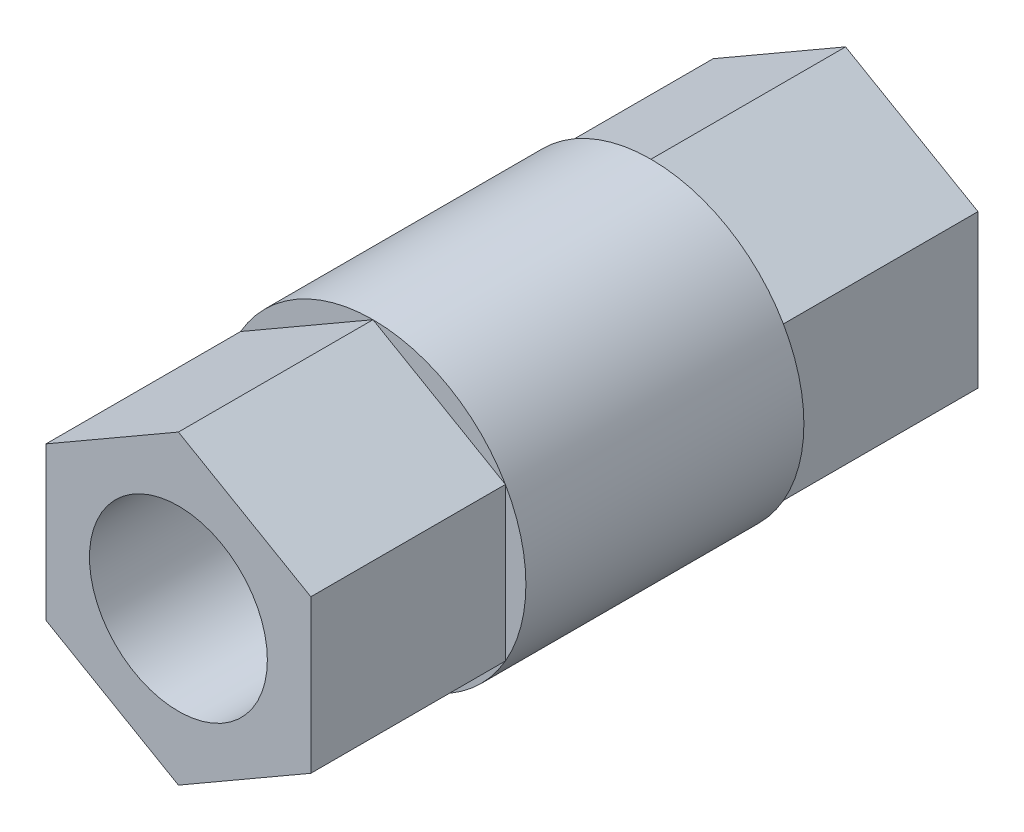
ISO-10303-21;
HEADER;
FILE_DESCRIPTION(('STEP AP214'),'2;1');
FILE_NAME('part.step','',(''),(''),'','','');
FILE_SCHEMA(('AUTOMOTIVE_DESIGN { 1 0 10303 214 1 1 1 1 }'));
ENDSEC;
DATA;
#1=APPLICATION_CONTEXT('core data for automotive mechanical design processes');
#2=APPLICATION_PROTOCOL_DEFINITION('international standard','automotive_design',2000,#1);
#3=PRODUCT_CONTEXT('',#1,'mechanical');
#4=PRODUCT('Part','Part','',(#3));
#5=PRODUCT_RELATED_PRODUCT_CATEGORY('part','',(#4));
#6=PRODUCT_DEFINITION_FORMATION('','',#4);
#7=PRODUCT_DEFINITION_CONTEXT('part definition',#1,'design');
#8=PRODUCT_DEFINITION('design','',#6,#7);
#9=PRODUCT_DEFINITION_SHAPE('','',#8);
#10=(LENGTH_UNIT() NAMED_UNIT(*) SI_UNIT(.MILLI.,.METRE.));
#11=(NAMED_UNIT(*) PLANE_ANGLE_UNIT() SI_UNIT($,.RADIAN.));
#12=(NAMED_UNIT(*) SI_UNIT($,.STERADIAN.) SOLID_ANGLE_UNIT());
#13=UNCERTAINTY_MEASURE_WITH_UNIT(LENGTH_MEASURE(1.E-05),#10,'distance_accuracy_value','');
#14=(GEOMETRIC_REPRESENTATION_CONTEXT(3) GLOBAL_UNCERTAINTY_ASSIGNED_CONTEXT((#13)) GLOBAL_UNIT_ASSIGNED_CONTEXT((#10,
#11,#12)) REPRESENTATION_CONTEXT('',''));
#15=CARTESIAN_POINT('',(0.,0.,0.));
#16=DIRECTION('',(0.,0.,1.));
#17=DIRECTION('',(1.,0.,0.));
#18=AXIS2_PLACEMENT_3D('',#15,#16,#17);
#19=CARTESIAN_POINT('',(0.,0.,10.));
#20=DIRECTION('',(0.,0.,1.));
#21=DIRECTION('',(1.,0.,0.));
#22=AXIS2_PLACEMENT_3D('',#19,#20,#21);
#23=PLANE('',#22);
#24=CARTESIAN_POINT('',(0.,0.,10.));
#25=DIRECTION('',(0.,0.,1.));
#26=DIRECTION('',(1.,0.,0.));
#27=AXIS2_PLACEMENT_3D('',#24,#25,#26);
#28=CIRCLE('',#27,11.);
#29=CARTESIAN_POINT('',(-9.52627944162882,5.5,10.));
#30=VERTEX_POINT('',#29);
#31=CARTESIAN_POINT('',(-9.52627944162882,-5.5,10.));
#32=VERTEX_POINT('',#31);
#33=EDGE_CURVE('E313',#30,#32,#28,.T.);
#34=ORIENTED_EDGE('',*,*,#33,.T.);
#35=DIRECTION('',(0.,1.,0.));
#36=VECTOR('',#35,1.);
#37=CARTESIAN_POINT('',(-9.52627944162882,0.,10.));
#38=LINE('',#37,#36);
#39=EDGE_CURVE('E153',#32,#30,#38,.T.);
#40=ORIENTED_EDGE('',*,*,#39,.T.);
#41=EDGE_LOOP('',(#34,#40));
#42=FACE_BOUND('',#41,.T.);
#43=ADVANCED_FACE('F39',(#42),#23,.T.);
#44=CARTESIAN_POINT('',(0.,-11.,10.));
#45=VERTEX_POINT('',#44);
#46=EDGE_CURVE('E314',#32,#45,#28,.T.);
#47=ORIENTED_EDGE('',*,*,#46,.T.);
#48=DIRECTION('',(-0.866025403784439,0.5,0.));
#49=VECTOR('',#48,1.);
#50=CARTESIAN_POINT('',(-4.76313972081441,-8.25,10.));
#51=LINE('',#50,#49);
#52=EDGE_CURVE('E171',#45,#32,#51,.T.);
#53=ORIENTED_EDGE('',*,*,#52,.T.);
#54=EDGE_LOOP('',(#47,#53));
#55=FACE_BOUND('',#54,.T.);
#56=ADVANCED_FACE('F291',(#55),#23,.T.);
#57=CARTESIAN_POINT('',(9.52627944162883,-5.5,10.));
#58=VERTEX_POINT('',#57);
#59=EDGE_CURVE('E316',#45,#58,#28,.T.);
#60=ORIENTED_EDGE('',*,*,#59,.T.);
#61=DIRECTION('',(-0.866025403784439,-0.5,0.));
#62=VECTOR('',#61,1.);
#63=CARTESIAN_POINT('',(4.76313972081441,-8.25,10.));
#64=LINE('',#63,#62);
#65=EDGE_CURVE('E168',#58,#45,#64,.T.);
#66=ORIENTED_EDGE('',*,*,#65,.T.);
#67=EDGE_LOOP('',(#60,#66));
#68=FACE_BOUND('',#67,.T.);
#69=ADVANCED_FACE('F296',(#68),#23,.T.);
#70=CARTESIAN_POINT('',(9.52627944162882,5.5,10.));
#71=VERTEX_POINT('',#70);
#72=EDGE_CURVE('E180',#58,#71,#28,.T.);
#73=ORIENTED_EDGE('',*,*,#72,.T.);
#74=DIRECTION('',(0.,-1.,0.));
#75=VECTOR('',#74,1.);
#76=CARTESIAN_POINT('',(9.52627944162882,0.,10.));
#77=LINE('',#76,#75);
#78=EDGE_CURVE('E165',#71,#58,#77,.T.);
#79=ORIENTED_EDGE('',*,*,#78,.T.);
#80=EDGE_LOOP('',(#73,#79));
#81=FACE_BOUND('',#80,.T.);
#82=ADVANCED_FACE('F306',(#81),#23,.T.);
#83=CARTESIAN_POINT('',(0.,11.,10.));
#84=VERTEX_POINT('',#83);
#85=EDGE_CURVE('E175',#71,#84,#28,.T.);
#86=ORIENTED_EDGE('',*,*,#85,.T.);
#87=DIRECTION('',(0.866025403784439,-0.5,0.));
#88=VECTOR('',#87,1.);
#89=CARTESIAN_POINT('',(4.76313972081441,8.25,10.));
#90=LINE('',#89,#88);
#91=EDGE_CURVE('E158',#84,#71,#90,.T.);
#92=ORIENTED_EDGE('',*,*,#91,.T.);
#93=EDGE_LOOP('',(#86,#92));
#94=FACE_BOUND('',#93,.T.);
#95=ADVANCED_FACE('F301',(#94),#23,.T.);
#96=EDGE_CURVE('E179',#84,#30,#28,.T.);
#97=ORIENTED_EDGE('',*,*,#96,.T.);
#98=DIRECTION('',(0.866025403784439,0.5,0.));
#99=VECTOR('',#98,1.);
#100=CARTESIAN_POINT('',(-4.76313972081441,8.25,10.));
#101=LINE('',#100,#99);
#102=EDGE_CURVE('E154',#30,#84,#101,.T.);
#103=ORIENTED_EDGE('',*,*,#102,.T.);
#104=EDGE_LOOP('',(#97,#103));
#105=FACE_BOUND('',#104,.T.);
#106=ADVANCED_FACE('F288',(#105),#23,.T.);
#107=CARTESIAN_POINT('',(0.,0.,-10.));
#108=DIRECTION('',(0.,0.,1.));
#109=DIRECTION('',(1.,0.,0.));
#110=AXIS2_PLACEMENT_3D('',#107,#108,#109);
#111=PLANE('',#110);
#112=DIRECTION('',(0.,1.,0.));
#113=VECTOR('',#112,1.);
#114=CARTESIAN_POINT('',(-9.52627944162882,0.,-10.));
#115=LINE('',#114,#113);
#116=CARTESIAN_POINT('',(-9.52627944162882,-5.50000000000001,-10.));
#117=VERTEX_POINT('',#116);
#118=CARTESIAN_POINT('',(-9.52627944162883,5.5,-10.));
#119=VERTEX_POINT('',#118);
#120=EDGE_CURVE('E11',#117,#119,#115,.T.);
#121=ORIENTED_EDGE('',*,*,#120,.F.);
#122=CARTESIAN_POINT('',(0.,0.,-10.));
#123=DIRECTION('',(0.,0.,1.));
#124=DIRECTION('',(1.,0.,0.));
#125=AXIS2_PLACEMENT_3D('',#122,#123,#124);
#126=CIRCLE('',#125,11.);
#127=EDGE_CURVE('E270',#119,#117,#126,.T.);
#128=ORIENTED_EDGE('',*,*,#127,.F.);
#129=EDGE_LOOP('',(#121,#128));
#130=FACE_BOUND('',#129,.T.);
#131=ADVANCED_FACE('F271',(#130),#111,.F.);
#132=DIRECTION('',(-0.866025403784439,0.5,0.));
#133=VECTOR('',#132,1.);
#134=CARTESIAN_POINT('',(-4.76313972081441,-8.25,-10.));
#135=LINE('',#134,#133);
#136=CARTESIAN_POINT('',(0.,-11.,-10.));
#137=VERTEX_POINT('',#136);
#138=EDGE_CURVE('E47',#137,#117,#135,.T.);
#139=ORIENTED_EDGE('',*,*,#138,.F.);
#140=EDGE_CURVE('E274',#117,#137,#126,.T.);
#141=ORIENTED_EDGE('',*,*,#140,.F.);
#142=EDGE_LOOP('',(#139,#141));
#143=FACE_BOUND('',#142,.T.);
#144=ADVANCED_FACE('F279',(#143),#111,.F.);
#145=DIRECTION('',(-0.866025403784439,-0.5,0.));
#146=VECTOR('',#145,1.);
#147=CARTESIAN_POINT('',(4.76313972081441,-8.25,-10.));
#148=LINE('',#147,#146);
#149=CARTESIAN_POINT('',(9.52627944162883,-5.5,-10.));
#150=VERTEX_POINT('',#149);
#151=EDGE_CURVE('E61',#150,#137,#148,.T.);
#152=ORIENTED_EDGE('',*,*,#151,.F.);
#153=EDGE_CURVE('E277',#137,#150,#126,.T.);
#154=ORIENTED_EDGE('',*,*,#153,.F.);
#155=EDGE_LOOP('',(#152,#154));
#156=FACE_BOUND('',#155,.T.);
#157=ADVANCED_FACE('F281',(#156),#111,.F.);
#158=DIRECTION('',(0.,-1.,0.));
#159=VECTOR('',#158,1.);
#160=CARTESIAN_POINT('',(9.52627944162882,0.,-10.));
#161=LINE('',#160,#159);
#162=CARTESIAN_POINT('',(9.52627944162882,5.50000000000001,-10.));
#163=VERTEX_POINT('',#162);
#164=EDGE_CURVE('E189',#163,#150,#161,.T.);
#165=ORIENTED_EDGE('',*,*,#164,.F.);
#166=EDGE_CURVE('E174',#150,#163,#126,.T.);
#167=ORIENTED_EDGE('',*,*,#166,.F.);
#168=EDGE_LOOP('',(#165,#167));
#169=FACE_BOUND('',#168,.T.);
#170=ADVANCED_FACE('F287',(#169),#111,.F.);
#171=DIRECTION('',(0.866025403784439,-0.5,0.));
#172=VECTOR('',#171,1.);
#173=CARTESIAN_POINT('',(4.76313972081441,8.25,-10.));
#174=LINE('',#173,#172);
#175=CARTESIAN_POINT('',(0.,11.,-10.));
#176=VERTEX_POINT('',#175);
#177=EDGE_CURVE('E186',#176,#163,#174,.T.);
#178=ORIENTED_EDGE('',*,*,#177,.F.);
#179=EDGE_CURVE('E181',#163,#176,#126,.T.);
#180=ORIENTED_EDGE('',*,*,#179,.F.);
#181=EDGE_LOOP('',(#178,#180));
#182=FACE_BOUND('',#181,.T.);
#183=ADVANCED_FACE('F260',(#182),#111,.F.);
#184=DIRECTION('',(0.866025403784439,0.5,0.));
#185=VECTOR('',#184,1.);
#186=CARTESIAN_POINT('',(-4.76313972081441,8.25,-10.));
#187=LINE('',#186,#185);
#188=EDGE_CURVE('E178',#119,#176,#187,.T.);
#189=ORIENTED_EDGE('',*,*,#188,.F.);
#190=EDGE_CURVE('E183',#176,#119,#126,.T.);
#191=ORIENTED_EDGE('',*,*,#190,.F.);
#192=EDGE_LOOP('',(#189,#191));
#193=FACE_BOUND('',#192,.T.);
#194=ADVANCED_FACE('F266',(#193),#111,.F.);
#195=CARTESIAN_POINT('',(0.,0.,10.));
#196=DIRECTION('',(0.,0.,-1.));
#197=DIRECTION('',(-1.,0.,0.));
#198=AXIS2_PLACEMENT_3D('',#195,#196,#197);
#199=CYLINDRICAL_SURFACE('',#198,11.);
#200=ORIENTED_EDGE('',*,*,#46,.F.);
#201=ORIENTED_EDGE('',*,*,#33,.F.);
#202=ORIENTED_EDGE('',*,*,#96,.F.);
#203=ORIENTED_EDGE('',*,*,#85,.F.);
#204=ORIENTED_EDGE('',*,*,#72,.F.);
#205=ORIENTED_EDGE('',*,*,#59,.F.);
#206=EDGE_LOOP('',(#200,#201,#202,#203,#204,#205));
#207=FACE_BOUND('',#206,.T.);
#208=ORIENTED_EDGE('',*,*,#127,.T.);
#209=ORIENTED_EDGE('',*,*,#140,.T.);
#210=ORIENTED_EDGE('',*,*,#153,.T.);
#211=ORIENTED_EDGE('',*,*,#166,.T.);
#212=ORIENTED_EDGE('',*,*,#179,.T.);
#213=ORIENTED_EDGE('',*,*,#190,.T.);
#214=EDGE_LOOP('',(#208,#209,#210,#211,#212,#213));
#215=FACE_BOUND('',#214,.T.);
#216=ADVANCED_FACE('F41',(#207,#215),#199,.T.);
#217=CARTESIAN_POINT('',(0.,0.,-24.));
#218=DIRECTION('',(0.,0.,1.));
#219=DIRECTION('',(1.,0.,0.));
#220=AXIS2_PLACEMENT_3D('',#217,#218,#219);
#221=PLANE('',#220);
#222=CARTESIAN_POINT('',(0.,0.,-24.));
#223=DIRECTION('',(0.,0.,1.));
#224=DIRECTION('',(1.,0.,0.));
#225=AXIS2_PLACEMENT_3D('',#222,#223,#224);
#226=CIRCLE('',#225,6.4);
#227=CARTESIAN_POINT('',(6.4,0.,-24.));
#228=VERTEX_POINT('',#227);
#229=EDGE_CURVE('E213',#228,#228,#226,.T.);
#230=ORIENTED_EDGE('',*,*,#229,.T.);
#231=EDGE_LOOP('',(#230));
#232=FACE_BOUND('',#231,.T.);
#233=DIRECTION('',(0.,-1.,0.));
#234=VECTOR('',#233,1.);
#235=CARTESIAN_POINT('',(-9.52627944162882,0.,-24.));
#236=LINE('',#235,#234);
#237=CARTESIAN_POINT('',(-9.52627944162882,5.5,-24.));
#238=VERTEX_POINT('',#237);
#239=CARTESIAN_POINT('',(-9.52627944162882,-5.5,-24.));
#240=VERTEX_POINT('',#239);
#241=EDGE_CURVE('E207',#238,#240,#236,.T.);
#242=ORIENTED_EDGE('',*,*,#241,.F.);
#243=DIRECTION('',(-0.866025403784439,-0.5,0.));
#244=VECTOR('',#243,1.);
#245=CARTESIAN_POINT('',(-4.76313972081441,8.25,-24.));
#246=LINE('',#245,#244);
#247=CARTESIAN_POINT('',(0.,11.,-24.));
#248=VERTEX_POINT('',#247);
#249=EDGE_CURVE('E229',#248,#238,#246,.T.);
#250=ORIENTED_EDGE('',*,*,#249,.F.);
#251=DIRECTION('',(-0.866025403784439,0.5,0.));
#252=VECTOR('',#251,1.);
#253=CARTESIAN_POINT('',(4.76313972081441,8.25,-24.));
#254=LINE('',#253,#252);
#255=CARTESIAN_POINT('',(9.52627944162882,5.5,-24.));
#256=VERTEX_POINT('',#255);
#257=EDGE_CURVE('E226',#256,#248,#254,.T.);
#258=ORIENTED_EDGE('',*,*,#257,.F.);
#259=DIRECTION('',(0.,1.,0.));
#260=VECTOR('',#259,1.);
#261=CARTESIAN_POINT('',(9.52627944162882,0.,-24.));
#262=LINE('',#261,#260);
#263=CARTESIAN_POINT('',(9.52627944162883,-5.5,-24.));
#264=VERTEX_POINT('',#263);
#265=EDGE_CURVE('E223',#264,#256,#262,.T.);
#266=ORIENTED_EDGE('',*,*,#265,.F.);
#267=DIRECTION('',(0.866025403784439,0.5,0.));
#268=VECTOR('',#267,1.);
#269=CARTESIAN_POINT('',(4.76313972081441,-8.25,-24.));
#270=LINE('',#269,#268);
#271=CARTESIAN_POINT('',(0.,-11.,-24.));
#272=VERTEX_POINT('',#271);
#273=EDGE_CURVE('E215',#272,#264,#270,.T.);
#274=ORIENTED_EDGE('',*,*,#273,.F.);
#275=DIRECTION('',(0.866025403784439,-0.5,0.));
#276=VECTOR('',#275,1.);
#277=CARTESIAN_POINT('',(-4.76313972081441,-8.25,-24.));
#278=LINE('',#277,#276);
#279=EDGE_CURVE('E212',#240,#272,#278,.T.);
#280=ORIENTED_EDGE('',*,*,#279,.F.);
#281=EDGE_LOOP('',(#242,#250,#258,#266,#274,#280));
#282=FACE_BOUND('',#281,.T.);
#283=ADVANCED_FACE('F253',(#232,#282),#221,.F.);
#284=CARTESIAN_POINT('',(-4.76313972081441,8.25,24.));
#285=DIRECTION('',(0.5,-0.866025403784439,0.));
#286=DIRECTION('',(0.866025403784439,0.5,0.));
#287=AXIS2_PLACEMENT_3D('',#284,#285,#286);
#288=PLANE('',#287);
#289=DIRECTION('',(0.,0.,-1.));
#290=VECTOR('',#289,1.);
#291=CARTESIAN_POINT('',(-9.52627944162882,5.5,24.));
#292=LINE('',#291,#290);
#293=EDGE_CURVE('E208',#119,#238,#292,.T.);
#294=ORIENTED_EDGE('',*,*,#293,.F.);
#295=ORIENTED_EDGE('',*,*,#188,.T.);
#296=DIRECTION('',(0.,0.,-1.));
#297=VECTOR('',#296,1.);
#298=CARTESIAN_POINT('',(0.,11.,24.));
#299=LINE('',#298,#297);
#300=EDGE_CURVE('E233',#176,#248,#299,.T.);
#301=ORIENTED_EDGE('',*,*,#300,.T.);
#302=ORIENTED_EDGE('',*,*,#249,.T.);
#303=EDGE_LOOP('',(#294,#295,#301,#302));
#304=FACE_BOUND('',#303,.T.);
#305=ADVANCED_FACE('F262',(#304),#288,.F.);
#306=CARTESIAN_POINT('',(4.76313972081441,8.25,24.));
#307=DIRECTION('',(-0.5,-0.866025403784439,0.));
#308=DIRECTION('',(0.866025403784439,-0.5,0.));
#309=AXIS2_PLACEMENT_3D('',#306,#307,#308);
#310=PLANE('',#309);
#311=ORIENTED_EDGE('',*,*,#300,.F.);
#312=ORIENTED_EDGE('',*,*,#177,.T.);
#313=DIRECTION('',(0.,0.,-1.));
#314=VECTOR('',#313,1.);
#315=CARTESIAN_POINT('',(9.52627944162882,5.5,24.));
#316=LINE('',#315,#314);
#317=EDGE_CURVE('E235',#163,#256,#316,.T.);
#318=ORIENTED_EDGE('',*,*,#317,.T.);
#319=ORIENTED_EDGE('',*,*,#257,.T.);
#320=EDGE_LOOP('',(#311,#312,#318,#319));
#321=FACE_BOUND('',#320,.T.);
#322=ADVANCED_FACE('F256',(#321),#310,.F.);
#323=CARTESIAN_POINT('',(9.52627944162882,0.,24.));
#324=DIRECTION('',(-1.,0.,0.));
#325=DIRECTION('',(0.,-1.,0.));
#326=AXIS2_PLACEMENT_3D('',#323,#324,#325);
#327=PLANE('',#326);
#328=ORIENTED_EDGE('',*,*,#317,.F.);
#329=ORIENTED_EDGE('',*,*,#164,.T.);
#330=DIRECTION('',(0.,0.,-1.));
#331=VECTOR('',#330,1.);
#332=CARTESIAN_POINT('',(9.52627944162883,-5.5,24.));
#333=LINE('',#332,#331);
#334=EDGE_CURVE('E238',#150,#264,#333,.T.);
#335=ORIENTED_EDGE('',*,*,#334,.T.);
#336=ORIENTED_EDGE('',*,*,#265,.T.);
#337=EDGE_LOOP('',(#328,#329,#335,#336));
#338=FACE_BOUND('',#337,.T.);
#339=ADVANCED_FACE('F247',(#338),#327,.F.);
#340=CARTESIAN_POINT('',(4.76313972081441,-8.25,24.));
#341=DIRECTION('',(-0.5,0.866025403784439,0.));
#342=DIRECTION('',(-0.866025403784439,-0.5,0.));
#343=AXIS2_PLACEMENT_3D('',#340,#341,#342);
#344=PLANE('',#343);
#345=ORIENTED_EDGE('',*,*,#334,.F.);
#346=ORIENTED_EDGE('',*,*,#151,.T.);
#347=DIRECTION('',(0.,0.,-1.));
#348=VECTOR('',#347,1.);
#349=CARTESIAN_POINT('',(0.,-11.,24.));
#350=LINE('',#349,#348);
#351=EDGE_CURVE('E199',#137,#272,#350,.T.);
#352=ORIENTED_EDGE('',*,*,#351,.T.);
#353=ORIENTED_EDGE('',*,*,#273,.T.);
#354=EDGE_LOOP('',(#345,#346,#352,#353));
#355=FACE_BOUND('',#354,.T.);
#356=ADVANCED_FACE('F252',(#355),#344,.F.);
#357=CARTESIAN_POINT('',(-4.76313972081441,-8.25,24.));
#358=DIRECTION('',(0.5,0.866025403784439,0.));
#359=DIRECTION('',(-0.866025403784439,0.5,0.));
#360=AXIS2_PLACEMENT_3D('',#357,#358,#359);
#361=PLANE('',#360);
#362=ORIENTED_EDGE('',*,*,#351,.F.);
#363=ORIENTED_EDGE('',*,*,#138,.T.);
#364=DIRECTION('',(0.,0.,-1.));
#365=VECTOR('',#364,1.);
#366=CARTESIAN_POINT('',(-9.52627944162882,-5.5,24.));
#367=LINE('',#366,#365);
#368=EDGE_CURVE('E155',#117,#240,#367,.T.);
#369=ORIENTED_EDGE('',*,*,#368,.T.);
#370=ORIENTED_EDGE('',*,*,#279,.T.);
#371=EDGE_LOOP('',(#362,#363,#369,#370));
#372=FACE_BOUND('',#371,.T.);
#373=ADVANCED_FACE('F196',(#372),#361,.F.);
#374=CARTESIAN_POINT('',(-9.52627944162882,0.,24.));
#375=DIRECTION('',(1.,0.,0.));
#376=DIRECTION('',(0.,1.,0.));
#377=AXIS2_PLACEMENT_3D('',#374,#375,#376);
#378=PLANE('',#377);
#379=ORIENTED_EDGE('',*,*,#368,.F.);
#380=ORIENTED_EDGE('',*,*,#120,.T.);
#381=ORIENTED_EDGE('',*,*,#293,.T.);
#382=ORIENTED_EDGE('',*,*,#241,.T.);
#383=EDGE_LOOP('',(#379,#380,#381,#382));
#384=FACE_BOUND('',#383,.T.);
#385=ADVANCED_FACE('F204',(#384),#378,.F.);
#386=CARTESIAN_POINT('',(0.,0.,10.));
#387=DIRECTION('',(0.,0.,-1.));
#388=DIRECTION('',(-1.,0.,0.));
#389=AXIS2_PLACEMENT_3D('',#386,#387,#388);
#390=CYLINDRICAL_SURFACE('',#389,6.4);
#391=ORIENTED_EDGE('',*,*,#229,.F.);
#392=EDGE_LOOP('',(#391));
#393=FACE_BOUND('',#392,.T.);
#394=CARTESIAN_POINT('',(0.,0.,24.));
#395=DIRECTION('',(0.,0.,1.));
#396=DIRECTION('',(1.,0.,0.));
#397=AXIS2_PLACEMENT_3D('',#394,#395,#396);
#398=CIRCLE('',#397,6.4);
#399=CARTESIAN_POINT('',(6.4,0.,24.));
#400=VERTEX_POINT('',#399);
#401=EDGE_CURVE('E149',#400,#400,#398,.T.);
#402=ORIENTED_EDGE('',*,*,#401,.T.);
#403=EDGE_LOOP('',(#402));
#404=FACE_BOUND('',#403,.T.);
#405=ADVANCED_FACE('F338',(#393,#404),#390,.F.);
#406=ORIENTED_EDGE('',*,*,#39,.F.);
#407=CARTESIAN_POINT('',(-9.52627944162882,-5.5,24.));
#408=VERTEX_POINT('',#407);
#409=EDGE_CURVE('E134',#408,#32,#367,.T.);
#410=ORIENTED_EDGE('',*,*,#409,.F.);
#411=DIRECTION('',(0.,-1.,0.));
#412=VECTOR('',#411,1.);
#413=CARTESIAN_POINT('',(-9.52627944162882,0.,24.));
#414=LINE('',#413,#412);
#415=CARTESIAN_POINT('',(-9.52627944162882,5.5,24.));
#416=VERTEX_POINT('',#415);
#417=EDGE_CURVE('E141',#416,#408,#414,.T.);
#418=ORIENTED_EDGE('',*,*,#417,.F.);
#419=EDGE_CURVE('E231',#416,#30,#292,.T.);
#420=ORIENTED_EDGE('',*,*,#419,.T.);
#421=EDGE_LOOP('',(#406,#410,#418,#420));
#422=FACE_BOUND('',#421,.T.);
#423=ADVANCED_FACE('F151',(#422),#378,.F.);
#424=ORIENTED_EDGE('',*,*,#52,.F.);
#425=CARTESIAN_POINT('',(0.,-11.,24.));
#426=VERTEX_POINT('',#425);
#427=EDGE_CURVE('E137',#426,#45,#350,.T.);
#428=ORIENTED_EDGE('',*,*,#427,.F.);
#429=DIRECTION('',(0.866025403784439,-0.5,0.));
#430=VECTOR('',#429,1.);
#431=CARTESIAN_POINT('',(-4.76313972081441,-8.25,24.));
#432=LINE('',#431,#430);
#433=EDGE_CURVE('E130',#408,#426,#432,.T.);
#434=ORIENTED_EDGE('',*,*,#433,.F.);
#435=ORIENTED_EDGE('',*,*,#409,.T.);
#436=EDGE_LOOP('',(#424,#428,#434,#435));
#437=FACE_BOUND('',#436,.T.);
#438=ADVANCED_FACE('F132',(#437),#361,.F.);
#439=ORIENTED_EDGE('',*,*,#65,.F.);
#440=CARTESIAN_POINT('',(9.52627944162883,-5.5,24.));
#441=VERTEX_POINT('',#440);
#442=EDGE_CURVE('E239',#441,#58,#333,.T.);
#443=ORIENTED_EDGE('',*,*,#442,.F.);
#444=DIRECTION('',(0.866025403784439,0.5,0.));
#445=VECTOR('',#444,1.);
#446=CARTESIAN_POINT('',(4.76313972081441,-8.25,24.));
#447=LINE('',#446,#445);
#448=EDGE_CURVE('E140',#426,#441,#447,.T.);
#449=ORIENTED_EDGE('',*,*,#448,.F.);
#450=ORIENTED_EDGE('',*,*,#427,.T.);
#451=EDGE_LOOP('',(#439,#443,#449,#450));
#452=FACE_BOUND('',#451,.T.);
#453=ADVANCED_FACE('F355',(#452),#344,.F.);
#454=ORIENTED_EDGE('',*,*,#78,.F.);
#455=CARTESIAN_POINT('',(9.52627944162882,5.5,24.));
#456=VERTEX_POINT('',#455);
#457=EDGE_CURVE('E236',#456,#71,#316,.T.);
#458=ORIENTED_EDGE('',*,*,#457,.F.);
#459=DIRECTION('',(0.,1.,0.));
#460=VECTOR('',#459,1.);
#461=CARTESIAN_POINT('',(9.52627944162882,0.,24.));
#462=LINE('',#461,#460);
#463=EDGE_CURVE('E330',#441,#456,#462,.T.);
#464=ORIENTED_EDGE('',*,*,#463,.F.);
#465=ORIENTED_EDGE('',*,*,#442,.T.);
#466=EDGE_LOOP('',(#454,#458,#464,#465));
#467=FACE_BOUND('',#466,.T.);
#468=ADVANCED_FACE('F329',(#467),#327,.F.);
#469=ORIENTED_EDGE('',*,*,#91,.F.);
#470=CARTESIAN_POINT('',(0.,11.,24.));
#471=VERTEX_POINT('',#470);
#472=EDGE_CURVE('E54',#471,#84,#299,.T.);
#473=ORIENTED_EDGE('',*,*,#472,.F.);
#474=DIRECTION('',(-0.866025403784439,0.5,0.));
#475=VECTOR('',#474,1.);
#476=CARTESIAN_POINT('',(4.76313972081441,8.25,24.));
#477=LINE('',#476,#475);
#478=EDGE_CURVE('E328',#456,#471,#477,.T.);
#479=ORIENTED_EDGE('',*,*,#478,.F.);
#480=ORIENTED_EDGE('',*,*,#457,.T.);
#481=EDGE_LOOP('',(#469,#473,#479,#480));
#482=FACE_BOUND('',#481,.T.);
#483=ADVANCED_FACE('F325',(#482),#310,.F.);
#484=ORIENTED_EDGE('',*,*,#102,.F.);
#485=ORIENTED_EDGE('',*,*,#419,.F.);
#486=DIRECTION('',(-0.866025403784439,-0.5,0.));
#487=VECTOR('',#486,1.);
#488=CARTESIAN_POINT('',(-4.76313972081441,8.25,24.));
#489=LINE('',#488,#487);
#490=EDGE_CURVE('E145',#471,#416,#489,.T.);
#491=ORIENTED_EDGE('',*,*,#490,.F.);
#492=ORIENTED_EDGE('',*,*,#472,.T.);
#493=EDGE_LOOP('',(#484,#485,#491,#492));
#494=FACE_BOUND('',#493,.T.);
#495=ADVANCED_FACE('F341',(#494),#288,.F.);
#496=CARTESIAN_POINT('',(0.,0.,24.));
#497=DIRECTION('',(0.,0.,1.));
#498=DIRECTION('',(1.,0.,0.));
#499=AXIS2_PLACEMENT_3D('',#496,#497,#498);
#500=PLANE('',#499);
#501=ORIENTED_EDGE('',*,*,#401,.F.);
#502=EDGE_LOOP('',(#501));
#503=FACE_BOUND('',#502,.T.);
#504=ORIENTED_EDGE('',*,*,#417,.T.);
#505=ORIENTED_EDGE('',*,*,#433,.T.);
#506=ORIENTED_EDGE('',*,*,#448,.T.);
#507=ORIENTED_EDGE('',*,*,#463,.T.);
#508=ORIENTED_EDGE('',*,*,#478,.T.);
#509=ORIENTED_EDGE('',*,*,#490,.T.);
#510=EDGE_LOOP('',(#504,#505,#506,#507,#508,#509));
#511=FACE_BOUND('',#510,.T.);
#512=ADVANCED_FACE('F144',(#503,#511),#500,.T.);
#513=CLOSED_SHELL('',(#43,#56,#69,#82,#95,#106,#131,#144,#157,#170,#183,#194,#216,#283,#305,
#322,#339,#356,#373,#385,#405,#423,#438,#453,#468,#483,#495,#512));
#514=MANIFOLD_SOLID_BREP('B2',#513);
#515=ADVANCED_BREP_SHAPE_REPRESENTATION('',(#18,#514),#14);
#516=SHAPE_DEFINITION_REPRESENTATION(#9,#515);
ENDSEC;
END-ISO-10303-21;
